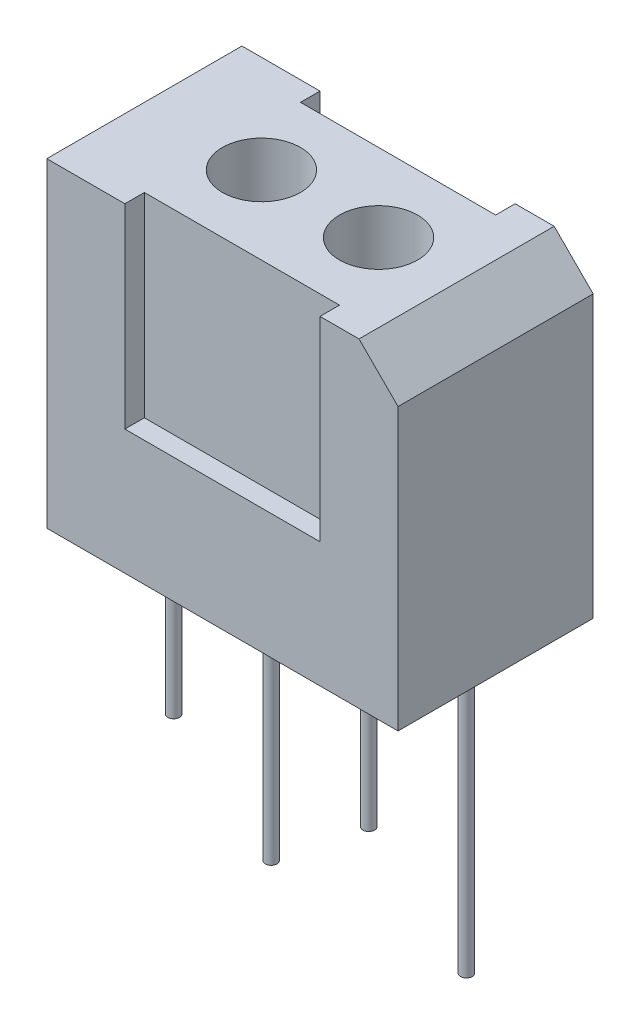
ISO-10303-21;
HEADER;
FILE_DESCRIPTION(('STEP AP214'),'2;1');
FILE_NAME('part.step','',(''),(''),'','','');
FILE_SCHEMA(('AUTOMOTIVE_DESIGN { 1 0 10303 214 1 1 1 1 }'));
ENDSEC;
DATA;
#1=APPLICATION_CONTEXT('core data for automotive mechanical design processes');
#2=APPLICATION_PROTOCOL_DEFINITION('international standard','automotive_design',2000,#1);
#3=PRODUCT_CONTEXT('',#1,'mechanical');
#4=PRODUCT('Part','Part','',(#3));
#5=PRODUCT_RELATED_PRODUCT_CATEGORY('part','',(#4));
#6=PRODUCT_DEFINITION_FORMATION('','',#4);
#7=PRODUCT_DEFINITION_CONTEXT('part definition',#1,'design');
#8=PRODUCT_DEFINITION('design','',#6,#7);
#9=PRODUCT_DEFINITION_SHAPE('','',#8);
#10=(LENGTH_UNIT() NAMED_UNIT(*) SI_UNIT(.MILLI.,.METRE.));
#11=(NAMED_UNIT(*) PLANE_ANGLE_UNIT() SI_UNIT($,.RADIAN.));
#12=(NAMED_UNIT(*) SI_UNIT($,.STERADIAN.) SOLID_ANGLE_UNIT());
#13=UNCERTAINTY_MEASURE_WITH_UNIT(LENGTH_MEASURE(1.E-05),#10,'distance_accuracy_value','');
#14=(GEOMETRIC_REPRESENTATION_CONTEXT(3) GLOBAL_UNCERTAINTY_ASSIGNED_CONTEXT((#13)) GLOBAL_UNIT_ASSIGNED_CONTEXT((#10,
#11,#12)) REPRESENTATION_CONTEXT('',''));
#15=CARTESIAN_POINT('',(0.,0.,0.));
#16=DIRECTION('',(0.,0.,1.));
#17=DIRECTION('',(1.,0.,0.));
#18=AXIS2_PLACEMENT_3D('',#15,#16,#17);
#19=CARTESIAN_POINT('',(4.5,4.1,2.5));
#20=DIRECTION('',(-1.,0.,0.));
#21=DIRECTION('',(0.,-1.,0.));
#22=AXIS2_PLACEMENT_3D('',#19,#20,#21);
#23=PLANE('',#22);
#24=DIRECTION('',(0.,1.,0.));
#25=VECTOR('',#24,1.);
#26=CARTESIAN_POINT('',(4.5,4.1,-2.5));
#27=LINE('',#26,#25);
#28=CARTESIAN_POINT('',(4.5,-4.1,-2.5));
#29=VERTEX_POINT('',#28);
#30=CARTESIAN_POINT('',(4.5,3.1,-2.5));
#31=VERTEX_POINT('',#30);
#32=EDGE_CURVE('E169',#29,#31,#27,.T.);
#33=ORIENTED_EDGE('',*,*,#32,.T.);
#34=DIRECTION('',(0.,0.,1.));
#35=VECTOR('',#34,1.);
#36=CARTESIAN_POINT('',(4.5,3.1,2.5));
#37=LINE('',#36,#35);
#38=CARTESIAN_POINT('',(4.5,3.1,2.5));
#39=VERTEX_POINT('',#38);
#40=EDGE_CURVE('E234',#31,#39,#37,.T.);
#41=ORIENTED_EDGE('',*,*,#40,.T.);
#42=DIRECTION('',(0.,1.,0.));
#43=VECTOR('',#42,1.);
#44=CARTESIAN_POINT('',(4.5,4.1,2.5));
#45=LINE('',#44,#43);
#46=CARTESIAN_POINT('',(4.5,-4.1,2.5));
#47=VERTEX_POINT('',#46);
#48=EDGE_CURVE('E199',#47,#39,#45,.T.);
#49=ORIENTED_EDGE('',*,*,#48,.F.);
#50=DIRECTION('',(0.,0.,-1.));
#51=VECTOR('',#50,1.);
#52=CARTESIAN_POINT('',(4.5,-4.1,2.5));
#53=LINE('',#52,#51);
#54=EDGE_CURVE('E211',#47,#29,#53,.T.);
#55=ORIENTED_EDGE('',*,*,#54,.T.);
#56=EDGE_LOOP('',(#33,#41,#49,#55));
#57=FACE_BOUND('',#56,.T.);
#58=ADVANCED_FACE('F37',(#57),#23,.F.);
#59=CARTESIAN_POINT('',(-4.5,4.1,2.5));
#60=DIRECTION('',(0.,-1.,0.));
#61=DIRECTION('',(1.,0.,0.));
#62=AXIS2_PLACEMENT_3D('',#59,#60,#61);
#63=PLANE('',#62);
#64=CARTESIAN_POINT('',(1.5,4.1,0.));
#65=DIRECTION('',(0.,1.,0.));
#66=DIRECTION('',(-1.,0.,0.));
#67=AXIS2_PLACEMENT_3D('',#64,#65,#66);
#68=CIRCLE('',#67,1.);
#69=CARTESIAN_POINT('',(0.499999999999999,4.1,0.));
#70=VERTEX_POINT('',#69);
#71=EDGE_CURVE('E536',#70,#70,#68,.T.);
#72=ORIENTED_EDGE('',*,*,#71,.F.);
#73=EDGE_LOOP('',(#72));
#74=FACE_BOUND('',#73,.T.);
#75=CARTESIAN_POINT('',(-1.5,4.1,0.));
#76=DIRECTION('',(0.,1.,0.));
#77=DIRECTION('',(1.,0.,0.));
#78=AXIS2_PLACEMENT_3D('',#75,#76,#77);
#79=CIRCLE('',#78,1.);
#80=CARTESIAN_POINT('',(-0.500000000000001,4.1,0.));
#81=VERTEX_POINT('',#80);
#82=EDGE_CURVE('E159',#81,#81,#79,.T.);
#83=ORIENTED_EDGE('',*,*,#82,.F.);
#84=EDGE_LOOP('',(#83));
#85=FACE_BOUND('',#84,.T.);
#86=DIRECTION('',(-1.,0.,0.));
#87=VECTOR('',#86,1.);
#88=CARTESIAN_POINT('',(2.5,4.1,2.));
#89=LINE('',#88,#87);
#90=CARTESIAN_POINT('',(2.5,4.1,2.));
#91=VERTEX_POINT('',#90);
#92=CARTESIAN_POINT('',(-2.5,4.1,2.));
#93=VERTEX_POINT('',#92);
#94=EDGE_CURVE('E156',#91,#93,#89,.T.);
#95=ORIENTED_EDGE('',*,*,#94,.F.);
#96=DIRECTION('',(0.,0.,-1.));
#97=VECTOR('',#96,1.);
#98=CARTESIAN_POINT('',(2.5,4.1,2.5));
#99=LINE('',#98,#97);
#100=CARTESIAN_POINT('',(2.5,4.1,2.5));
#101=VERTEX_POINT('',#100);
#102=EDGE_CURVE('E141',#101,#91,#99,.T.);
#103=ORIENTED_EDGE('',*,*,#102,.F.);
#104=DIRECTION('',(-1.,0.,0.));
#105=VECTOR('',#104,1.);
#106=CARTESIAN_POINT('',(-4.5,4.1,2.5));
#107=LINE('',#106,#105);
#108=CARTESIAN_POINT('',(3.5,4.1,2.5));
#109=VERTEX_POINT('',#108);
#110=EDGE_CURVE('E204',#109,#101,#107,.T.);
#111=ORIENTED_EDGE('',*,*,#110,.F.);
#112=DIRECTION('',(0.,0.,-1.));
#113=VECTOR('',#112,1.);
#114=CARTESIAN_POINT('',(3.5,4.1,2.5));
#115=LINE('',#114,#113);
#116=CARTESIAN_POINT('',(3.5,4.1,-2.5));
#117=VERTEX_POINT('',#116);
#118=EDGE_CURVE('E229',#109,#117,#115,.T.);
#119=ORIENTED_EDGE('',*,*,#118,.T.);
#120=DIRECTION('',(-1.,0.,0.));
#121=VECTOR('',#120,1.);
#122=CARTESIAN_POINT('',(-4.5,4.1,-2.5));
#123=LINE('',#122,#121);
#124=CARTESIAN_POINT('',(2.5,4.1,-2.5));
#125=VERTEX_POINT('',#124);
#126=EDGE_CURVE('E215',#117,#125,#123,.T.);
#127=ORIENTED_EDGE('',*,*,#126,.T.);
#128=DIRECTION('',(0.,0.,-1.));
#129=VECTOR('',#128,1.);
#130=CARTESIAN_POINT('',(2.5,4.1,-2.5));
#131=LINE('',#130,#129);
#132=CARTESIAN_POINT('',(2.5,4.1,-2.));
#133=VERTEX_POINT('',#132);
#134=EDGE_CURVE('E177',#133,#125,#131,.T.);
#135=ORIENTED_EDGE('',*,*,#134,.F.);
#136=DIRECTION('',(1.,0.,0.));
#137=VECTOR('',#136,1.);
#138=CARTESIAN_POINT('',(2.5,4.1,-2.));
#139=LINE('',#138,#137);
#140=CARTESIAN_POINT('',(-2.5,4.1,-2.));
#141=VERTEX_POINT('',#140);
#142=EDGE_CURVE('E187',#141,#133,#139,.T.);
#143=ORIENTED_EDGE('',*,*,#142,.F.);
#144=DIRECTION('',(0.,0.,1.));
#145=VECTOR('',#144,1.);
#146=CARTESIAN_POINT('',(-2.5,4.1,-2.5));
#147=LINE('',#146,#145);
#148=CARTESIAN_POINT('',(-2.5,4.1,-2.5));
#149=VERTEX_POINT('',#148);
#150=EDGE_CURVE('E184',#149,#141,#147,.T.);
#151=ORIENTED_EDGE('',*,*,#150,.F.);
#152=CARTESIAN_POINT('',(-4.5,4.1,-2.5));
#153=VERTEX_POINT('',#152);
#154=EDGE_CURVE('E214',#149,#153,#123,.T.);
#155=ORIENTED_EDGE('',*,*,#154,.T.);
#156=DIRECTION('',(0.,0.,-1.));
#157=VECTOR('',#156,1.);
#158=CARTESIAN_POINT('',(-4.5,4.1,2.5));
#159=LINE('',#158,#157);
#160=CARTESIAN_POINT('',(-4.5,4.1,2.5));
#161=VERTEX_POINT('',#160);
#162=EDGE_CURVE('E226',#161,#153,#159,.T.);
#163=ORIENTED_EDGE('',*,*,#162,.F.);
#164=CARTESIAN_POINT('',(-2.5,4.1,2.5));
#165=VERTEX_POINT('',#164);
#166=EDGE_CURVE('E202',#165,#161,#107,.T.);
#167=ORIENTED_EDGE('',*,*,#166,.F.);
#168=DIRECTION('',(0.,0.,1.));
#169=VECTOR('',#168,1.);
#170=CARTESIAN_POINT('',(-2.5,4.1,2.5));
#171=LINE('',#170,#169);
#172=EDGE_CURVE('E154',#93,#165,#171,.T.);
#173=ORIENTED_EDGE('',*,*,#172,.F.);
#174=EDGE_LOOP('',(#95,#103,#111,#119,#127,#135,#143,#151,#155,#163,#167,#173));
#175=FACE_BOUND('',#174,.T.);
#176=ADVANCED_FACE('F277',(#74,#85,#175),#63,.F.);
#177=CARTESIAN_POINT('',(-4.5,4.1,2.5));
#178=DIRECTION('',(1.,0.,0.));
#179=DIRECTION('',(0.,0.,-1.));
#180=AXIS2_PLACEMENT_3D('',#177,#178,#179);
#181=PLANE('',#180);
#182=DIRECTION('',(0.,-1.,0.));
#183=VECTOR('',#182,1.);
#184=CARTESIAN_POINT('',(-4.5,4.1,-2.5));
#185=LINE('',#184,#183);
#186=CARTESIAN_POINT('',(-4.5,-4.1,-2.5));
#187=VERTEX_POINT('',#186);
#188=EDGE_CURVE('E218',#153,#187,#185,.T.);
#189=ORIENTED_EDGE('',*,*,#188,.T.);
#190=DIRECTION('',(0.,0.,-1.));
#191=VECTOR('',#190,1.);
#192=CARTESIAN_POINT('',(-4.5,-4.1,2.5));
#193=LINE('',#192,#191);
#194=CARTESIAN_POINT('',(-4.5,-4.1,2.5));
#195=VERTEX_POINT('',#194);
#196=EDGE_CURVE('E223',#195,#187,#193,.T.);
#197=ORIENTED_EDGE('',*,*,#196,.F.);
#198=DIRECTION('',(0.,-1.,0.));
#199=VECTOR('',#198,1.);
#200=CARTESIAN_POINT('',(-4.5,4.1,2.5));
#201=LINE('',#200,#199);
#202=EDGE_CURVE('E207',#161,#195,#201,.T.);
#203=ORIENTED_EDGE('',*,*,#202,.F.);
#204=ORIENTED_EDGE('',*,*,#162,.T.);
#205=EDGE_LOOP('',(#189,#197,#203,#204));
#206=FACE_BOUND('',#205,.T.);
#207=ADVANCED_FACE('F252',(#206),#181,.F.);
#208=CARTESIAN_POINT('',(-4.5,-4.1,2.5));
#209=DIRECTION('',(0.,1.,0.));
#210=DIRECTION('',(0.,0.,1.));
#211=AXIS2_PLACEMENT_3D('',#208,#209,#210);
#212=PLANE('',#211);
#213=CARTESIAN_POINT('',(3.75,-4.1,0.));
#214=DIRECTION('',(0.,1.,0.));
#215=DIRECTION('',(0.,0.,1.));
#216=AXIS2_PLACEMENT_3D('',#213,#214,#215);
#217=CIRCLE('',#216,0.15);
#218=CARTESIAN_POINT('',(3.75,-4.1,0.15));
#219=VERTEX_POINT('',#218);
#220=EDGE_CURVE('E11',#219,#219,#217,.F.);
#221=ORIENTED_EDGE('',*,*,#220,.F.);
#222=EDGE_LOOP('',(#221));
#223=FACE_BOUND('',#222,.T.);
#224=CARTESIAN_POINT('',(-1.25,-4.1,0.));
#225=DIRECTION('',(0.,1.,0.));
#226=DIRECTION('',(0.,0.,1.));
#227=AXIS2_PLACEMENT_3D('',#224,#225,#226);
#228=CIRCLE('',#227,0.15);
#229=CARTESIAN_POINT('',(-1.25,-4.1,0.15));
#230=VERTEX_POINT('',#229);
#231=EDGE_CURVE('E45',#230,#230,#228,.F.);
#232=ORIENTED_EDGE('',*,*,#231,.F.);
#233=EDGE_LOOP('',(#232));
#234=FACE_BOUND('',#233,.T.);
#235=CARTESIAN_POINT('',(-3.75,-4.1,0.));
#236=DIRECTION('',(0.,1.,0.));
#237=DIRECTION('',(0.,0.,1.));
#238=AXIS2_PLACEMENT_3D('',#235,#236,#237);
#239=CIRCLE('',#238,0.15);
#240=CARTESIAN_POINT('',(-3.75,-4.1,0.15));
#241=VERTEX_POINT('',#240);
#242=EDGE_CURVE('E241',#241,#241,#239,.F.);
#243=ORIENTED_EDGE('',*,*,#242,.F.);
#244=EDGE_LOOP('',(#243));
#245=FACE_BOUND('',#244,.T.);
#246=CARTESIAN_POINT('',(1.25,-4.1,0.));
#247=DIRECTION('',(0.,1.,0.));
#248=DIRECTION('',(0.,0.,1.));
#249=AXIS2_PLACEMENT_3D('',#246,#247,#248);
#250=CIRCLE('',#249,0.15);
#251=CARTESIAN_POINT('',(1.25,-4.1,0.15));
#252=VERTEX_POINT('',#251);
#253=EDGE_CURVE('E238',#252,#252,#250,.F.);
#254=ORIENTED_EDGE('',*,*,#253,.F.);
#255=EDGE_LOOP('',(#254));
#256=FACE_BOUND('',#255,.T.);
#257=DIRECTION('',(1.,0.,0.));
#258=VECTOR('',#257,1.);
#259=CARTESIAN_POINT('',(-4.5,-4.1,-2.5));
#260=LINE('',#259,#258);
#261=EDGE_CURVE('E203',#187,#29,#260,.T.);
#262=ORIENTED_EDGE('',*,*,#261,.T.);
#263=ORIENTED_EDGE('',*,*,#54,.F.);
#264=DIRECTION('',(1.,0.,0.));
#265=VECTOR('',#264,1.);
#266=CARTESIAN_POINT('',(-4.5,-4.1,2.5));
#267=LINE('',#266,#265);
#268=EDGE_CURVE('E209',#195,#47,#267,.T.);
#269=ORIENTED_EDGE('',*,*,#268,.F.);
#270=ORIENTED_EDGE('',*,*,#196,.T.);
#271=EDGE_LOOP('',(#262,#263,#269,#270));
#272=FACE_BOUND('',#271,.T.);
#273=ADVANCED_FACE('F248',(#223,#234,#245,#256,#272),#212,.F.);
#274=CARTESIAN_POINT('',(0.,0.,2.5));
#275=DIRECTION('',(0.,0.,1.));
#276=DIRECTION('',(1.,0.,0.));
#277=AXIS2_PLACEMENT_3D('',#274,#275,#276);
#278=PLANE('',#277);
#279=DIRECTION('',(0.,1.,0.));
#280=VECTOR('',#279,1.);
#281=CARTESIAN_POINT('',(2.5,-0.899999999999999,2.5));
#282=LINE('',#281,#280);
#283=CARTESIAN_POINT('',(2.5,-0.899999999999999,2.5));
#284=VERTEX_POINT('',#283);
#285=EDGE_CURVE('E167',#284,#101,#282,.T.);
#286=ORIENTED_EDGE('',*,*,#285,.F.);
#287=DIRECTION('',(1.,0.,0.));
#288=VECTOR('',#287,1.);
#289=CARTESIAN_POINT('',(2.5,-0.899999999999999,2.5));
#290=LINE('',#289,#288);
#291=CARTESIAN_POINT('',(-2.5,-0.900000000000001,2.5));
#292=VERTEX_POINT('',#291);
#293=EDGE_CURVE('E146',#292,#284,#290,.T.);
#294=ORIENTED_EDGE('',*,*,#293,.F.);
#295=DIRECTION('',(0.,1.,0.));
#296=VECTOR('',#295,1.);
#297=CARTESIAN_POINT('',(-2.5,-0.900000000000001,2.5));
#298=LINE('',#297,#296);
#299=EDGE_CURVE('E170',#292,#165,#298,.T.);
#300=ORIENTED_EDGE('',*,*,#299,.T.);
#301=ORIENTED_EDGE('',*,*,#166,.T.);
#302=ORIENTED_EDGE('',*,*,#202,.T.);
#303=ORIENTED_EDGE('',*,*,#268,.T.);
#304=ORIENTED_EDGE('',*,*,#48,.T.);
#305=DIRECTION('',(0.707106781186546,-0.707106781186549,0.));
#306=VECTOR('',#305,1.);
#307=CARTESIAN_POINT('',(3.80000000000001,3.79999999999999,2.5));
#308=LINE('',#307,#306);
#309=EDGE_CURVE('E236',#39,#109,#308,.F.);
#310=ORIENTED_EDGE('',*,*,#309,.T.);
#311=ORIENTED_EDGE('',*,*,#110,.T.);
#312=EDGE_LOOP('',(#286,#294,#300,#301,#302,#303,#304,#310,#311));
#313=FACE_BOUND('',#312,.T.);
#314=ADVANCED_FACE('F251',(#313),#278,.T.);
#315=CARTESIAN_POINT('',(0.,0.,-2.5));
#316=DIRECTION('',(0.,0.,1.));
#317=DIRECTION('',(1.,0.,0.));
#318=AXIS2_PLACEMENT_3D('',#315,#316,#317);
#319=PLANE('',#318);
#320=DIRECTION('',(-1.,0.,0.));
#321=VECTOR('',#320,1.);
#322=CARTESIAN_POINT('',(2.5,-0.899999999999999,-2.5));
#323=LINE('',#322,#321);
#324=CARTESIAN_POINT('',(2.5,-0.899999999999999,-2.5));
#325=VERTEX_POINT('',#324);
#326=CARTESIAN_POINT('',(-2.5,-0.900000000000001,-2.5));
#327=VERTEX_POINT('',#326);
#328=EDGE_CURVE('E174',#325,#327,#323,.T.);
#329=ORIENTED_EDGE('',*,*,#328,.F.);
#330=DIRECTION('',(0.,1.,0.));
#331=VECTOR('',#330,1.);
#332=CARTESIAN_POINT('',(2.5,-0.899999999999999,-2.5));
#333=LINE('',#332,#331);
#334=EDGE_CURVE('E165',#325,#125,#333,.T.);
#335=ORIENTED_EDGE('',*,*,#334,.T.);
#336=ORIENTED_EDGE('',*,*,#126,.F.);
#337=DIRECTION('',(-0.707106781186546,0.707106781186549,0.));
#338=VECTOR('',#337,1.);
#339=CARTESIAN_POINT('',(3.5,4.1,-2.5));
#340=LINE('',#339,#338);
#341=EDGE_CURVE('E232',#117,#31,#340,.F.);
#342=ORIENTED_EDGE('',*,*,#341,.T.);
#343=ORIENTED_EDGE('',*,*,#32,.F.);
#344=ORIENTED_EDGE('',*,*,#261,.F.);
#345=ORIENTED_EDGE('',*,*,#188,.F.);
#346=ORIENTED_EDGE('',*,*,#154,.F.);
#347=DIRECTION('',(0.,1.,0.));
#348=VECTOR('',#347,1.);
#349=CARTESIAN_POINT('',(-2.5,-0.900000000000001,-2.5));
#350=LINE('',#349,#348);
#351=EDGE_CURVE('E183',#327,#149,#350,.T.);
#352=ORIENTED_EDGE('',*,*,#351,.F.);
#353=EDGE_LOOP('',(#329,#335,#336,#342,#343,#344,#345,#346,#352));
#354=FACE_BOUND('',#353,.T.);
#355=ADVANCED_FACE('F270',(#354),#319,.F.);
#356=CARTESIAN_POINT('',(3.5,4.1,2.5));
#357=DIRECTION('',(-0.707106781186549,-0.707106781186546,0.));
#358=DIRECTION('',(0.,0.,-1.));
#359=AXIS2_PLACEMENT_3D('',#356,#357,#358);
#360=PLANE('',#359);
#361=ORIENTED_EDGE('',*,*,#309,.F.);
#362=ORIENTED_EDGE('',*,*,#40,.F.);
#363=ORIENTED_EDGE('',*,*,#341,.F.);
#364=ORIENTED_EDGE('',*,*,#118,.F.);
#365=EDGE_LOOP('',(#361,#362,#363,#364));
#366=FACE_BOUND('',#365,.T.);
#367=ADVANCED_FACE('F39',(#366),#360,.F.);
#368=CARTESIAN_POINT('',(2.5,-0.899999999999999,-2.5));
#369=DIRECTION('',(1.,0.,0.));
#370=DIRECTION('',(0.,1.,0.));
#371=AXIS2_PLACEMENT_3D('',#368,#369,#370);
#372=PLANE('',#371);
#373=ORIENTED_EDGE('',*,*,#134,.T.);
#374=ORIENTED_EDGE('',*,*,#334,.F.);
#375=DIRECTION('',(0.,0.,-1.));
#376=VECTOR('',#375,1.);
#377=CARTESIAN_POINT('',(2.5,-0.899999999999999,-2.5));
#378=LINE('',#377,#376);
#379=CARTESIAN_POINT('',(2.5,-0.899999999999999,-2.));
#380=VERTEX_POINT('',#379);
#381=EDGE_CURVE('E60',#380,#325,#378,.T.);
#382=ORIENTED_EDGE('',*,*,#381,.F.);
#383=DIRECTION('',(0.,1.,0.));
#384=VECTOR('',#383,1.);
#385=CARTESIAN_POINT('',(2.5,-0.899999999999999,-2.));
#386=LINE('',#385,#384);
#387=EDGE_CURVE('E194',#380,#133,#386,.T.);
#388=ORIENTED_EDGE('',*,*,#387,.T.);
#389=EDGE_LOOP('',(#373,#374,#382,#388));
#390=FACE_BOUND('',#389,.T.);
#391=ADVANCED_FACE('F293',(#390),#372,.F.);
#392=CARTESIAN_POINT('',(2.5,-0.899999999999999,-2.));
#393=DIRECTION('',(0.,0.,1.));
#394=DIRECTION('',(1.,0.,0.));
#395=AXIS2_PLACEMENT_3D('',#392,#393,#394);
#396=PLANE('',#395);
#397=ORIENTED_EDGE('',*,*,#142,.T.);
#398=ORIENTED_EDGE('',*,*,#387,.F.);
#399=DIRECTION('',(1.,0.,0.));
#400=VECTOR('',#399,1.);
#401=CARTESIAN_POINT('',(2.5,-0.899999999999999,-2.));
#402=LINE('',#401,#400);
#403=CARTESIAN_POINT('',(-2.5,-0.900000000000001,-2.));
#404=VERTEX_POINT('',#403);
#405=EDGE_CURVE('E180',#404,#380,#402,.T.);
#406=ORIENTED_EDGE('',*,*,#405,.F.);
#407=DIRECTION('',(0.,1.,0.));
#408=VECTOR('',#407,1.);
#409=CARTESIAN_POINT('',(-2.5,-0.900000000000001,-2.));
#410=LINE('',#409,#408);
#411=EDGE_CURVE('E196',#404,#141,#410,.T.);
#412=ORIENTED_EDGE('',*,*,#411,.T.);
#413=EDGE_LOOP('',(#397,#398,#406,#412));
#414=FACE_BOUND('',#413,.T.);
#415=ADVANCED_FACE('F295',(#414),#396,.F.);
#416=CARTESIAN_POINT('',(-2.5,-0.900000000000001,-2.5));
#417=DIRECTION('',(-1.,0.,0.));
#418=DIRECTION('',(0.,-1.,0.));
#419=AXIS2_PLACEMENT_3D('',#416,#417,#418);
#420=PLANE('',#419);
#421=ORIENTED_EDGE('',*,*,#150,.T.);
#422=ORIENTED_EDGE('',*,*,#411,.F.);
#423=DIRECTION('',(0.,0.,1.));
#424=VECTOR('',#423,1.);
#425=CARTESIAN_POINT('',(-2.5,-0.900000000000001,-2.5));
#426=LINE('',#425,#424);
#427=EDGE_CURVE('E176',#327,#404,#426,.T.);
#428=ORIENTED_EDGE('',*,*,#427,.F.);
#429=ORIENTED_EDGE('',*,*,#351,.T.);
#430=EDGE_LOOP('',(#421,#422,#428,#429));
#431=FACE_BOUND('',#430,.T.);
#432=ADVANCED_FACE('F289',(#431),#420,.F.);
#433=CARTESIAN_POINT('',(0.,-0.9,0.));
#434=DIRECTION('',(0.,1.,0.));
#435=DIRECTION('',(-1.,0.,0.));
#436=AXIS2_PLACEMENT_3D('',#433,#434,#435);
#437=PLANE('',#436);
#438=ORIENTED_EDGE('',*,*,#328,.T.);
#439=ORIENTED_EDGE('',*,*,#427,.T.);
#440=ORIENTED_EDGE('',*,*,#405,.T.);
#441=ORIENTED_EDGE('',*,*,#381,.T.);
#442=EDGE_LOOP('',(#438,#439,#440,#441));
#443=FACE_BOUND('',#442,.T.);
#444=ADVANCED_FACE('F291',(#443),#437,.T.);
#445=CARTESIAN_POINT('',(2.5,-0.899999999999999,2.5));
#446=DIRECTION('',(1.,0.,0.));
#447=DIRECTION('',(0.,1.,0.));
#448=AXIS2_PLACEMENT_3D('',#445,#446,#447);
#449=PLANE('',#448);
#450=ORIENTED_EDGE('',*,*,#102,.T.);
#451=DIRECTION('',(0.,1.,0.));
#452=VECTOR('',#451,1.);
#453=CARTESIAN_POINT('',(2.5,-0.899999999999999,2.));
#454=LINE('',#453,#452);
#455=CARTESIAN_POINT('',(2.5,-0.899999999999999,2.));
#456=VERTEX_POINT('',#455);
#457=EDGE_CURVE('E135',#456,#91,#454,.T.);
#458=ORIENTED_EDGE('',*,*,#457,.F.);
#459=DIRECTION('',(0.,0.,-1.));
#460=VECTOR('',#459,1.);
#461=CARTESIAN_POINT('',(2.5,-0.899999999999999,2.5));
#462=LINE('',#461,#460);
#463=EDGE_CURVE('E139',#284,#456,#462,.T.);
#464=ORIENTED_EDGE('',*,*,#463,.F.);
#465=ORIENTED_EDGE('',*,*,#285,.T.);
#466=EDGE_LOOP('',(#450,#458,#464,#465));
#467=FACE_BOUND('',#466,.T.);
#468=ADVANCED_FACE('F137',(#467),#449,.F.);
#469=CARTESIAN_POINT('',(-2.5,-0.900000000000001,2.5));
#470=DIRECTION('',(-1.,0.,0.));
#471=DIRECTION('',(0.,-1.,0.));
#472=AXIS2_PLACEMENT_3D('',#469,#470,#471);
#473=PLANE('',#472);
#474=ORIENTED_EDGE('',*,*,#172,.T.);
#475=ORIENTED_EDGE('',*,*,#299,.F.);
#476=DIRECTION('',(0.,0.,1.));
#477=VECTOR('',#476,1.);
#478=CARTESIAN_POINT('',(-2.5,-0.900000000000001,2.5));
#479=LINE('',#478,#477);
#480=CARTESIAN_POINT('',(-2.5,-0.900000000000001,2.));
#481=VERTEX_POINT('',#480);
#482=EDGE_CURVE('E52',#481,#292,#479,.T.);
#483=ORIENTED_EDGE('',*,*,#482,.F.);
#484=DIRECTION('',(0.,1.,0.));
#485=VECTOR('',#484,1.);
#486=CARTESIAN_POINT('',(-2.5,-0.900000000000001,2.));
#487=LINE('',#486,#485);
#488=EDGE_CURVE('E145',#481,#93,#487,.T.);
#489=ORIENTED_EDGE('',*,*,#488,.T.);
#490=EDGE_LOOP('',(#474,#475,#483,#489));
#491=FACE_BOUND('',#490,.T.);
#492=ADVANCED_FACE('F360',(#491),#473,.F.);
#493=CARTESIAN_POINT('',(2.5,-0.899999999999999,2.));
#494=DIRECTION('',(0.,0.,-1.));
#495=DIRECTION('',(-1.,0.,0.));
#496=AXIS2_PLACEMENT_3D('',#493,#494,#495);
#497=PLANE('',#496);
#498=ORIENTED_EDGE('',*,*,#94,.T.);
#499=ORIENTED_EDGE('',*,*,#488,.F.);
#500=DIRECTION('',(-1.,0.,0.));
#501=VECTOR('',#500,1.);
#502=CARTESIAN_POINT('',(2.5,-0.899999999999999,2.));
#503=LINE('',#502,#501);
#504=EDGE_CURVE('E148',#456,#481,#503,.T.);
#505=ORIENTED_EDGE('',*,*,#504,.F.);
#506=ORIENTED_EDGE('',*,*,#457,.T.);
#507=EDGE_LOOP('',(#498,#499,#505,#506));
#508=FACE_BOUND('',#507,.T.);
#509=ADVANCED_FACE('F149',(#508),#497,.F.);
#510=CARTESIAN_POINT('',(0.,-0.9,0.));
#511=DIRECTION('',(0.,1.,0.));
#512=DIRECTION('',(-1.,0.,0.));
#513=AXIS2_PLACEMENT_3D('',#510,#511,#512);
#514=PLANE('',#513);
#515=ORIENTED_EDGE('',*,*,#463,.T.);
#516=ORIENTED_EDGE('',*,*,#504,.T.);
#517=ORIENTED_EDGE('',*,*,#482,.T.);
#518=ORIENTED_EDGE('',*,*,#293,.T.);
#519=EDGE_LOOP('',(#515,#516,#517,#518));
#520=FACE_BOUND('',#519,.T.);
#521=ADVANCED_FACE('F151',(#520),#514,.T.);
#522=CARTESIAN_POINT('',(-1.5,2.1,0.));
#523=DIRECTION('',(0.,1.,0.));
#524=DIRECTION('',(-1.,0.,0.));
#525=AXIS2_PLACEMENT_3D('',#522,#523,#524);
#526=CYLINDRICAL_SURFACE('',#525,1.);
#527=CARTESIAN_POINT('',(-1.5,2.1,0.));
#528=DIRECTION('',(0.,1.,0.));
#529=DIRECTION('',(1.,0.,0.));
#530=AXIS2_PLACEMENT_3D('',#527,#528,#529);
#531=CIRCLE('',#530,1.);
#532=CARTESIAN_POINT('',(-0.5,2.1,0.));
#533=VERTEX_POINT('',#532);
#534=EDGE_CURVE('E538',#533,#533,#531,.T.);
#535=ORIENTED_EDGE('',*,*,#534,.F.);
#536=EDGE_LOOP('',(#535));
#537=FACE_BOUND('',#536,.T.);
#538=ORIENTED_EDGE('',*,*,#82,.T.);
#539=EDGE_LOOP('',(#538));
#540=FACE_BOUND('',#539,.T.);
#541=ADVANCED_FACE('F386',(#537,#540),#526,.F.);
#542=CARTESIAN_POINT('',(-1.5,2.1,0.));
#543=DIRECTION('',(0.,-1.,0.));
#544=DIRECTION('',(1.,0.,0.));
#545=AXIS2_PLACEMENT_3D('',#542,#543,#544);
#546=PLANE('',#545);
#547=ORIENTED_EDGE('',*,*,#534,.T.);
#548=EDGE_LOOP('',(#547));
#549=FACE_BOUND('',#548,.T.);
#550=ADVANCED_FACE('F403',(#549),#546,.F.);
#551=CARTESIAN_POINT('',(1.5,2.1,0.));
#552=DIRECTION('',(0.,1.,0.));
#553=DIRECTION('',(-1.,0.,0.));
#554=AXIS2_PLACEMENT_3D('',#551,#552,#553);
#555=CYLINDRICAL_SURFACE('',#554,1.);
#556=CARTESIAN_POINT('',(1.5,2.1,0.));
#557=DIRECTION('',(0.,1.,0.));
#558=DIRECTION('',(-1.,0.,0.));
#559=AXIS2_PLACEMENT_3D('',#556,#557,#558);
#560=CIRCLE('',#559,1.);
#561=CARTESIAN_POINT('',(0.499999999999999,2.1,0.));
#562=VERTEX_POINT('',#561);
#563=EDGE_CURVE('E188',#562,#562,#560,.T.);
#564=ORIENTED_EDGE('',*,*,#563,.F.);
#565=EDGE_LOOP('',(#564));
#566=FACE_BOUND('',#565,.T.);
#567=ORIENTED_EDGE('',*,*,#71,.T.);
#568=EDGE_LOOP('',(#567));
#569=FACE_BOUND('',#568,.T.);
#570=ADVANCED_FACE('F413',(#566,#569),#555,.F.);
#571=CARTESIAN_POINT('',(1.5,2.1,0.));
#572=DIRECTION('',(0.,1.,0.));
#573=DIRECTION('',(-1.,0.,0.));
#574=AXIS2_PLACEMENT_3D('',#571,#572,#573);
#575=PLANE('',#574);
#576=ORIENTED_EDGE('',*,*,#563,.T.);
#577=EDGE_LOOP('',(#576));
#578=FACE_BOUND('',#577,.T.);
#579=ADVANCED_FACE('F423',(#578),#575,.T.);
#580=CARTESIAN_POINT('',(1.25,-9.1,0.));
#581=DIRECTION('',(0.,1.,0.));
#582=DIRECTION('',(0.,0.,1.));
#583=AXIS2_PLACEMENT_3D('',#580,#581,#582);
#584=CYLINDRICAL_SURFACE('',#583,0.15);
#585=CARTESIAN_POINT('',(1.25,-9.1,0.));
#586=DIRECTION('',(0.,-1.,0.));
#587=DIRECTION('',(0.,0.,-1.));
#588=AXIS2_PLACEMENT_3D('',#585,#586,#587);
#589=CIRCLE('',#588,0.15);
#590=CARTESIAN_POINT('',(1.25,-9.1,-0.15));
#591=VERTEX_POINT('',#590);
#592=EDGE_CURVE('E531',#591,#591,#589,.T.);
#593=ORIENTED_EDGE('',*,*,#592,.F.);
#594=EDGE_LOOP('',(#593));
#595=FACE_BOUND('',#594,.T.);
#596=ORIENTED_EDGE('',*,*,#253,.T.);
#597=EDGE_LOOP('',(#596));
#598=FACE_BOUND('',#597,.T.);
#599=ADVANCED_FACE('F433',(#595,#598),#584,.T.);
#600=CARTESIAN_POINT('',(1.25,-9.1,0.));
#601=DIRECTION('',(0.,-1.,0.));
#602=DIRECTION('',(0.,0.,-1.));
#603=AXIS2_PLACEMENT_3D('',#600,#601,#602);
#604=PLANE('',#603);
#605=ORIENTED_EDGE('',*,*,#592,.T.);
#606=EDGE_LOOP('',(#605));
#607=FACE_BOUND('',#606,.T.);
#608=ADVANCED_FACE('F443',(#607),#604,.T.);
#609=CARTESIAN_POINT('',(-3.75,-9.1,0.));
#610=DIRECTION('',(0.,1.,0.));
#611=DIRECTION('',(0.,0.,1.));
#612=AXIS2_PLACEMENT_3D('',#609,#610,#611);
#613=CYLINDRICAL_SURFACE('',#612,0.15);
#614=CARTESIAN_POINT('',(-3.75,-9.1,0.));
#615=DIRECTION('',(0.,-1.,0.));
#616=DIRECTION('',(0.,0.,-1.));
#617=AXIS2_PLACEMENT_3D('',#614,#615,#616);
#618=CIRCLE('',#617,0.15);
#619=CARTESIAN_POINT('',(-3.75,-9.1,-0.15));
#620=VERTEX_POINT('',#619);
#621=EDGE_CURVE('E526',#620,#620,#618,.T.);
#622=ORIENTED_EDGE('',*,*,#621,.F.);
#623=EDGE_LOOP('',(#622));
#624=FACE_BOUND('',#623,.T.);
#625=ORIENTED_EDGE('',*,*,#242,.T.);
#626=EDGE_LOOP('',(#625));
#627=FACE_BOUND('',#626,.T.);
#628=ADVANCED_FACE('F453',(#624,#627),#613,.T.);
#629=CARTESIAN_POINT('',(-3.75,-9.1,0.));
#630=DIRECTION('',(0.,-1.,0.));
#631=DIRECTION('',(0.,0.,-1.));
#632=AXIS2_PLACEMENT_3D('',#629,#630,#631);
#633=PLANE('',#632);
#634=ORIENTED_EDGE('',*,*,#621,.T.);
#635=EDGE_LOOP('',(#634));
#636=FACE_BOUND('',#635,.T.);
#637=ADVANCED_FACE('F463',(#636),#633,.T.);
#638=CARTESIAN_POINT('',(-1.25,-11.1,0.));
#639=DIRECTION('',(0.,1.,0.));
#640=DIRECTION('',(0.,0.,1.));
#641=AXIS2_PLACEMENT_3D('',#638,#639,#640);
#642=CYLINDRICAL_SURFACE('',#641,0.15);
#643=CARTESIAN_POINT('',(-1.25,-11.1,0.));
#644=DIRECTION('',(0.,-1.,0.));
#645=DIRECTION('',(0.,0.,-1.));
#646=AXIS2_PLACEMENT_3D('',#643,#644,#645);
#647=CIRCLE('',#646,0.15);
#648=CARTESIAN_POINT('',(-1.25,-11.1,-0.15));
#649=VERTEX_POINT('',#648);
#650=EDGE_CURVE('E523',#649,#649,#647,.T.);
#651=ORIENTED_EDGE('',*,*,#650,.F.);
#652=EDGE_LOOP('',(#651));
#653=FACE_BOUND('',#652,.T.);
#654=ORIENTED_EDGE('',*,*,#231,.T.);
#655=EDGE_LOOP('',(#654));
#656=FACE_BOUND('',#655,.T.);
#657=ADVANCED_FACE('F246',(#653,#656),#642,.T.);
#658=CARTESIAN_POINT('',(-1.25,-11.1,0.));
#659=DIRECTION('',(0.,-1.,0.));
#660=DIRECTION('',(0.,0.,-1.));
#661=AXIS2_PLACEMENT_3D('',#658,#659,#660);
#662=PLANE('',#661);
#663=ORIENTED_EDGE('',*,*,#650,.T.);
#664=EDGE_LOOP('',(#663));
#665=FACE_BOUND('',#664,.T.);
#666=ADVANCED_FACE('F486',(#665),#662,.T.);
#667=CARTESIAN_POINT('',(3.75,-11.1,0.));
#668=DIRECTION('',(0.,1.,0.));
#669=DIRECTION('',(0.,0.,1.));
#670=AXIS2_PLACEMENT_3D('',#667,#668,#669);
#671=CYLINDRICAL_SURFACE('',#670,0.15);
#672=CARTESIAN_POINT('',(3.75,-11.1,0.));
#673=DIRECTION('',(0.,-1.,0.));
#674=DIRECTION('',(0.,0.,-1.));
#675=AXIS2_PLACEMENT_3D('',#672,#673,#674);
#676=CIRCLE('',#675,0.15);
#677=CARTESIAN_POINT('',(3.75,-11.1,-0.15));
#678=VERTEX_POINT('',#677);
#679=EDGE_CURVE('E522',#678,#678,#676,.T.);
#680=ORIENTED_EDGE('',*,*,#679,.F.);
#681=EDGE_LOOP('',(#680));
#682=FACE_BOUND('',#681,.T.);
#683=ORIENTED_EDGE('',*,*,#220,.T.);
#684=EDGE_LOOP('',(#683));
#685=FACE_BOUND('',#684,.T.);
#686=ADVANCED_FACE('F496',(#682,#685),#671,.T.);
#687=CARTESIAN_POINT('',(3.75,-11.1,0.));
#688=DIRECTION('',(0.,-1.,0.));
#689=DIRECTION('',(0.,0.,-1.));
#690=AXIS2_PLACEMENT_3D('',#687,#688,#689);
#691=PLANE('',#690);
#692=ORIENTED_EDGE('',*,*,#679,.T.);
#693=EDGE_LOOP('',(#692));
#694=FACE_BOUND('',#693,.T.);
#695=ADVANCED_FACE('F506',(#694),#691,.T.);
#696=CLOSED_SHELL('',(#58,#176,#207,#273,#314,#355,#367,#391,#415,#432,#444,#468,#492,#509,#521,
#541,#550,#570,#579,#599,#608,#628,#637,#657,#666,#686,#695));
#697=MANIFOLD_SOLID_BREP('B2',#696);
#698=ADVANCED_BREP_SHAPE_REPRESENTATION('',(#18,#697),#14);
#699=SHAPE_DEFINITION_REPRESENTATION(#9,#698);
ENDSEC;
END-ISO-10303-21;
